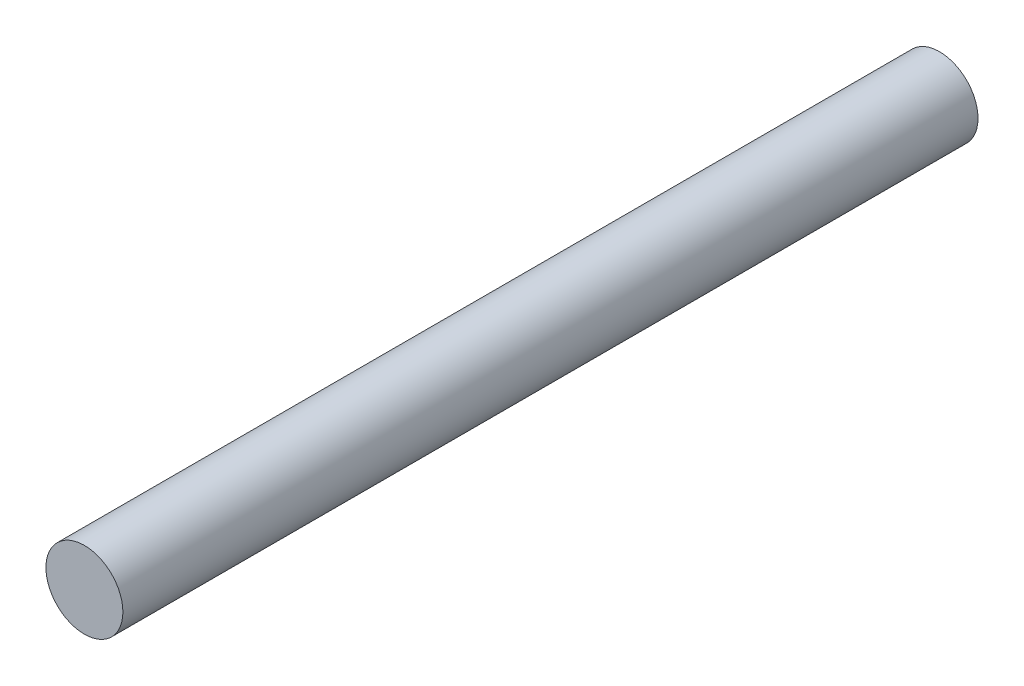
ISO-10303-21;
HEADER;
FILE_DESCRIPTION(('STEP AP214'),'2;1');
FILE_NAME('part.step','',(''),(''),'','','');
FILE_SCHEMA(('AUTOMOTIVE_DESIGN { 1 0 10303 214 1 1 1 1 }'));
ENDSEC;
DATA;
#1=APPLICATION_CONTEXT('core data for automotive mechanical design processes');
#2=APPLICATION_PROTOCOL_DEFINITION('international standard','automotive_design',2000,#1);
#3=PRODUCT_CONTEXT('',#1,'mechanical');
#4=PRODUCT('Part','Part','',(#3));
#5=PRODUCT_RELATED_PRODUCT_CATEGORY('part','',(#4));
#6=PRODUCT_DEFINITION_FORMATION('','',#4);
#7=PRODUCT_DEFINITION_CONTEXT('part definition',#1,'design');
#8=PRODUCT_DEFINITION('design','',#6,#7);
#9=PRODUCT_DEFINITION_SHAPE('','',#8);
#10=(LENGTH_UNIT() NAMED_UNIT(*) SI_UNIT(.MILLI.,.METRE.));
#11=(NAMED_UNIT(*) PLANE_ANGLE_UNIT() SI_UNIT($,.RADIAN.));
#12=(NAMED_UNIT(*) SI_UNIT($,.STERADIAN.) SOLID_ANGLE_UNIT());
#13=UNCERTAINTY_MEASURE_WITH_UNIT(LENGTH_MEASURE(1.E-05),#10,'distance_accuracy_value','');
#14=(GEOMETRIC_REPRESENTATION_CONTEXT(3) GLOBAL_UNCERTAINTY_ASSIGNED_CONTEXT((#13)) GLOBAL_UNIT_ASSIGNED_CONTEXT((#10,
#11,#12)) REPRESENTATION_CONTEXT('',''));
#15=CARTESIAN_POINT('',(0.,0.,0.));
#16=DIRECTION('',(0.,0.,1.));
#17=DIRECTION('',(1.,0.,0.));
#18=AXIS2_PLACEMENT_3D('',#15,#16,#17);
#19=CARTESIAN_POINT('',(0.,0.,200.));
#20=DIRECTION('',(0.,0.,-1.));
#21=DIRECTION('',(-1.,0.,0.));
#22=AXIS2_PLACEMENT_3D('',#19,#20,#21);
#23=CYLINDRICAL_SURFACE('',#22,9.);
#24=CARTESIAN_POINT('',(0.,0.,200.));
#25=DIRECTION('',(0.,0.,1.));
#26=DIRECTION('',(1.,0.,0.));
#27=AXIS2_PLACEMENT_3D('',#24,#25,#26);
#28=CIRCLE('',#27,9.);
#29=CARTESIAN_POINT('',(9.,0.,200.));
#30=VERTEX_POINT('',#29);
#31=EDGE_CURVE('E10',#30,#30,#28,.T.);
#32=ORIENTED_EDGE('',*,*,#31,.F.);
#33=EDGE_LOOP('',(#32));
#34=FACE_BOUND('',#33,.T.);
#35=CARTESIAN_POINT('',(0.,0.,0.));
#36=DIRECTION('',(0.,0.,1.));
#37=DIRECTION('',(1.,0.,0.));
#38=AXIS2_PLACEMENT_3D('',#35,#36,#37);
#39=CIRCLE('',#38,9.);
#40=CARTESIAN_POINT('',(9.,0.,0.));
#41=VERTEX_POINT('',#40);
#42=EDGE_CURVE('E40',#41,#41,#39,.T.);
#43=ORIENTED_EDGE('',*,*,#42,.T.);
#44=EDGE_LOOP('',(#43));
#45=FACE_BOUND('',#44,.T.);
#46=ADVANCED_FACE('F37',(#34,#45),#23,.T.);
#47=CARTESIAN_POINT('',(0.,0.,200.));
#48=DIRECTION('',(0.,0.,1.));
#49=DIRECTION('',(1.,0.,0.));
#50=AXIS2_PLACEMENT_3D('',#47,#48,#49);
#51=PLANE('',#50);
#52=ORIENTED_EDGE('',*,*,#31,.T.);
#53=EDGE_LOOP('',(#52));
#54=FACE_BOUND('',#53,.T.);
#55=ADVANCED_FACE('F54',(#54),#51,.T.);
#56=CARTESIAN_POINT('',(0.,0.,0.));
#57=DIRECTION('',(0.,0.,1.));
#58=DIRECTION('',(1.,0.,0.));
#59=AXIS2_PLACEMENT_3D('',#56,#57,#58);
#60=PLANE('',#59);
#61=ORIENTED_EDGE('',*,*,#42,.F.);
#62=EDGE_LOOP('',(#61));
#63=FACE_BOUND('',#62,.T.);
#64=ADVANCED_FACE('F52',(#63),#60,.F.);
#65=CLOSED_SHELL('',(#46,#55,#64));
#66=MANIFOLD_SOLID_BREP('B2',#65);
#67=ADVANCED_BREP_SHAPE_REPRESENTATION('',(#18,#66),#14);
#68=SHAPE_DEFINITION_REPRESENTATION(#9,#67);
ENDSEC;
END-ISO-10303-21;
